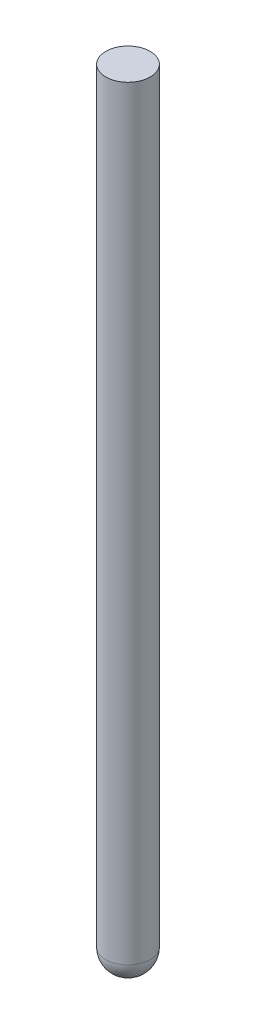
ISO-10303-21;
HEADER;
FILE_DESCRIPTION(('STEP AP214'),'2;1');
FILE_NAME('part.step','',(''),(''),'','','');
FILE_SCHEMA(('AUTOMOTIVE_DESIGN { 1 0 10303 214 1 1 1 1 }'));
ENDSEC;
DATA;
#1=APPLICATION_CONTEXT('core data for automotive mechanical design processes');
#2=APPLICATION_PROTOCOL_DEFINITION('international standard','automotive_design',2000,#1);
#3=PRODUCT_CONTEXT('',#1,'mechanical');
#4=PRODUCT('Part','Part','',(#3));
#5=PRODUCT_RELATED_PRODUCT_CATEGORY('part','',(#4));
#6=PRODUCT_DEFINITION_FORMATION('','',#4);
#7=PRODUCT_DEFINITION_CONTEXT('part definition',#1,'design');
#8=PRODUCT_DEFINITION('design','',#6,#7);
#9=PRODUCT_DEFINITION_SHAPE('','',#8);
#10=(LENGTH_UNIT() NAMED_UNIT(*) SI_UNIT(.MILLI.,.METRE.));
#11=(NAMED_UNIT(*) PLANE_ANGLE_UNIT() SI_UNIT($,.RADIAN.));
#12=(NAMED_UNIT(*) SI_UNIT($,.STERADIAN.) SOLID_ANGLE_UNIT());
#13=UNCERTAINTY_MEASURE_WITH_UNIT(LENGTH_MEASURE(1.E-05),#10,'distance_accuracy_value','');
#14=(GEOMETRIC_REPRESENTATION_CONTEXT(3) GLOBAL_UNCERTAINTY_ASSIGNED_CONTEXT((#13)) GLOBAL_UNIT_ASSIGNED_CONTEXT((#10,
#11,#12)) REPRESENTATION_CONTEXT('',''));
#15=CARTESIAN_POINT('',(0.,0.,0.));
#16=DIRECTION('',(0.,0.,1.));
#17=DIRECTION('',(1.,0.,0.));
#18=AXIS2_PLACEMENT_3D('',#15,#16,#17);
#19=CARTESIAN_POINT('',(0.,177.800000000001,0.));
#20=DIRECTION('',(0.,-0.999999999999998,0.));
#21=DIRECTION('',(0.,0.,-1.00000000000001));
#22=AXIS2_PLACEMENT_3D('',#19,#20,#21);
#23=CYLINDRICAL_SURFACE('',#22,5.02632183727009);
#24=CARTESIAN_POINT('',(-6.66133814775094E-13,4.95299999999999,-4.44089209850063E-13));
#25=DIRECTION('',(0.,0.999999999999998,0.));
#26=DIRECTION('',(0.,0.,1.00000000000001));
#27=AXIS2_PLACEMENT_3D('',#24,#25,#26);
#28=CIRCLE('',#27,5.02632183727009);
#29=CARTESIAN_POINT('',(-6.68644966979905E-13,4.95299999999999,5.02632183726968));
#30=VERTEX_POINT('',#29);
#31=EDGE_CURVE('E57',#30,#30,#28,.T.);
#32=ORIENTED_EDGE('',*,*,#31,.T.);
#33=EDGE_LOOP('',(#32));
#34=FACE_BOUND('',#33,.T.);
#35=CARTESIAN_POINT('',(0.,177.800000000001,0.));
#36=DIRECTION('',(0.,0.999999999999998,0.));
#37=DIRECTION('',(0.,0.,1.00000000000001));
#38=AXIS2_PLACEMENT_3D('',#35,#36,#37);
#39=CIRCLE('',#38,5.02632183727009);
#40=CARTESIAN_POINT('',(0.,177.800000000001,5.02632183727012));
#41=VERTEX_POINT('',#40);
#42=EDGE_CURVE('E61',#41,#41,#39,.T.);
#43=ORIENTED_EDGE('',*,*,#42,.F.);
#44=EDGE_LOOP('',(#43));
#45=FACE_BOUND('',#44,.T.);
#46=ADVANCED_FACE('F50',(#34,#45),#23,.T.);
#47=CARTESIAN_POINT('',(0.,177.800000000001,0.));
#48=DIRECTION('',(0.,0.999999999999998,0.));
#49=DIRECTION('',(0.,0.,1.00000000000001));
#50=AXIS2_PLACEMENT_3D('',#47,#48,#49);
#51=PLANE('',#50);
#52=ORIENTED_EDGE('',*,*,#42,.T.);
#53=EDGE_LOOP('',(#52));
#54=FACE_BOUND('',#53,.T.);
#55=ADVANCED_FACE('F68',(#54),#51,.T.);
#56=CARTESIAN_POINT('',(0.,0.,0.));
#57=DIRECTION('',(0.,0.999999999999998,0.));
#58=DIRECTION('',(0.,0.,1.00000000000001));
#59=AXIS2_PLACEMENT_3D('',#56,#57,#58);
#60=PLANE('',#59);
#61=CARTESIAN_POINT('',(0.,0.,0.));
#62=DIRECTION('',(0.,0.999999999999998,0.));
#63=DIRECTION('',(0.,0.,1.00000000000001));
#64=AXIS2_PLACEMENT_3D('',#61,#62,#63);
#65=CIRCLE('',#64,0.0733218372700947);
#66=CARTESIAN_POINT('',(0.,0.,0.0733218372700951));
#67=VERTEX_POINT('',#66);
#68=EDGE_CURVE('E12',#67,#67,#65,.F.);
#69=ORIENTED_EDGE('',*,*,#68,.T.);
#70=EDGE_LOOP('',(#69));
#71=FACE_BOUND('',#70,.T.);
#72=ADVANCED_FACE('F74',(#71),#60,.F.);
#73=CARTESIAN_POINT('',(-6.66133814775094E-13,4.95299999999999,-4.44089209850063E-13));
#74=DIRECTION('',(0.,0.999999999999998,0.));
#75=DIRECTION('',(0.,0.,1.00000000000001));
#76=AXIS2_PLACEMENT_3D('',#73,#74,#75);
#77=DEGENERATE_TOROIDAL_SURFACE('',#76,0.0733218372700947,4.953,.T.);
#78=ORIENTED_EDGE('',*,*,#68,.F.);
#79=EDGE_LOOP('',(#78));
#80=FACE_BOUND('',#79,.T.);
#81=ORIENTED_EDGE('',*,*,#31,.F.);
#82=EDGE_LOOP('',(#81));
#83=FACE_BOUND('',#82,.T.);
#84=ADVANCED_FACE('F52',(#80,#83),#77,.T.);
#85=CLOSED_SHELL('',(#46,#55,#72,#84));
#86=MANIFOLD_SOLID_BREP('B2',#85);
#87=ADVANCED_BREP_SHAPE_REPRESENTATION('',(#18,#86),#14);
#88=SHAPE_DEFINITION_REPRESENTATION(#9,#87);
ENDSEC;
END-ISO-10303-21;
